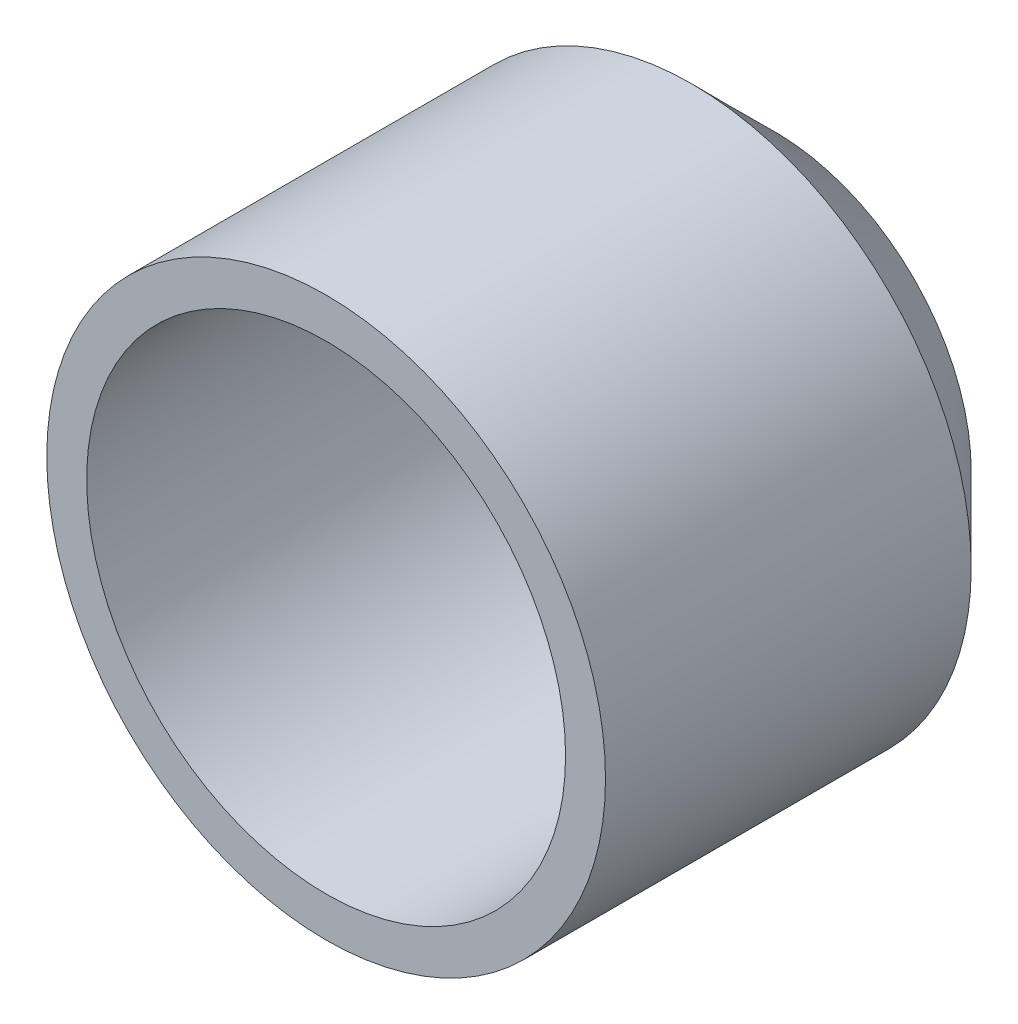
ISO-10303-21;
HEADER;
FILE_DESCRIPTION(('STEP AP214'),'2;1');
FILE_NAME('part.step','',(''),(''),'','','');
FILE_SCHEMA(('AUTOMOTIVE_DESIGN { 1 0 10303 214 1 1 1 1 }'));
ENDSEC;
DATA;
#1=APPLICATION_CONTEXT('core data for automotive mechanical design processes');
#2=APPLICATION_PROTOCOL_DEFINITION('international standard','automotive_design',2000,#1);
#3=PRODUCT_CONTEXT('',#1,'mechanical');
#4=PRODUCT('Part','Part','',(#3));
#5=PRODUCT_RELATED_PRODUCT_CATEGORY('part','',(#4));
#6=PRODUCT_DEFINITION_FORMATION('','',#4);
#7=PRODUCT_DEFINITION_CONTEXT('part definition',#1,'design');
#8=PRODUCT_DEFINITION('design','',#6,#7);
#9=PRODUCT_DEFINITION_SHAPE('','',#8);
#10=(LENGTH_UNIT() NAMED_UNIT(*) SI_UNIT(.MILLI.,.METRE.));
#11=(NAMED_UNIT(*) PLANE_ANGLE_UNIT() SI_UNIT($,.RADIAN.));
#12=(NAMED_UNIT(*) SI_UNIT($,.STERADIAN.) SOLID_ANGLE_UNIT());
#13=UNCERTAINTY_MEASURE_WITH_UNIT(LENGTH_MEASURE(1.E-05),#10,'distance_accuracy_value','');
#14=(GEOMETRIC_REPRESENTATION_CONTEXT(3) GLOBAL_UNCERTAINTY_ASSIGNED_CONTEXT((#13)) GLOBAL_UNIT_ASSIGNED_CONTEXT((#10,
#11,#12)) REPRESENTATION_CONTEXT('',''));
#15=CARTESIAN_POINT('',(0.,0.,0.));
#16=DIRECTION('',(0.,0.,1.));
#17=DIRECTION('',(1.,0.,0.));
#18=AXIS2_PLACEMENT_3D('',#15,#16,#17);
#19=CARTESIAN_POINT('',(0.,0.,0.));
#20=DIRECTION('',(0.,0.,1.));
#21=DIRECTION('',(1.,0.,0.));
#22=AXIS2_PLACEMENT_3D('',#19,#20,#21);
#23=PLANE('',#22);
#24=CARTESIAN_POINT('',(0.,0.,0.));
#25=DIRECTION('',(0.,0.,1.));
#26=DIRECTION('',(1.,0.,0.));
#27=AXIS2_PLACEMENT_3D('',#24,#25,#26);
#28=CIRCLE('',#27,19.6568542494924);
#29=CARTESIAN_POINT('',(19.6568542494924,0.,0.));
#30=VERTEX_POINT('',#29);
#31=EDGE_CURVE('E10',#30,#30,#28,.T.);
#32=ORIENTED_EDGE('',*,*,#31,.F.);
#33=EDGE_LOOP('',(#32));
#34=FACE_BOUND('',#33,.T.);
#35=ADVANCED_FACE('F33',(#34),#23,.F.);
#36=CARTESIAN_POINT('',(0.,0.,0.));
#37=DIRECTION('',(0.,0.,1.));
#38=DIRECTION('',(1.,0.,0.));
#39=AXIS2_PLACEMENT_3D('',#36,#37,#38);
#40=CONICAL_SURFACE('',#39,19.6568542494924,0.78539816339745);
#41=CARTESIAN_POINT('',(0.,0.,8.3431457505076));
#42=DIRECTION('',(0.,0.,1.));
#43=DIRECTION('',(1.,0.,0.));
#44=AXIS2_PLACEMENT_3D('',#41,#42,#43);
#45=CIRCLE('',#44,28.);
#46=CARTESIAN_POINT('',(28.,0.,8.3431457505076));
#47=VERTEX_POINT('',#46);
#48=EDGE_CURVE('E39',#47,#47,#45,.T.);
#49=ORIENTED_EDGE('',*,*,#48,.F.);
#50=EDGE_LOOP('',(#49));
#51=FACE_BOUND('',#50,.T.);
#52=ORIENTED_EDGE('',*,*,#31,.T.);
#53=EDGE_LOOP('',(#52));
#54=FACE_BOUND('',#53,.T.);
#55=ADVANCED_FACE('F81',(#51,#54),#40,.T.);
#56=CARTESIAN_POINT('',(0.,0.,4.));
#57=DIRECTION('',(0.,0.,1.));
#58=DIRECTION('',(1.,0.,0.));
#59=AXIS2_PLACEMENT_3D('',#56,#57,#58);
#60=CYLINDRICAL_SURFACE('',#59,28.);
#61=CARTESIAN_POINT('',(0.,0.,45.));
#62=DIRECTION('',(0.,0.,1.));
#63=DIRECTION('',(1.,0.,0.));
#64=AXIS2_PLACEMENT_3D('',#61,#62,#63);
#65=CIRCLE('',#64,28.);
#66=CARTESIAN_POINT('',(28.,0.,45.));
#67=VERTEX_POINT('',#66);
#68=EDGE_CURVE('E43',#67,#67,#65,.T.);
#69=ORIENTED_EDGE('',*,*,#68,.F.);
#70=EDGE_LOOP('',(#69));
#71=FACE_BOUND('',#70,.T.);
#72=ORIENTED_EDGE('',*,*,#48,.T.);
#73=EDGE_LOOP('',(#72));
#74=FACE_BOUND('',#73,.T.);
#75=ADVANCED_FACE('F76',(#71,#74),#60,.T.);
#76=CARTESIAN_POINT('',(0.,28.,45.));
#77=DIRECTION('',(0.,0.,-1.));
#78=DIRECTION('',(-1.,0.,0.));
#79=AXIS2_PLACEMENT_3D('',#76,#77,#78);
#80=PLANE('',#79);
#81=CARTESIAN_POINT('',(0.,0.,45.));
#82=DIRECTION('',(0.,0.,1.));
#83=DIRECTION('',(1.,0.,0.));
#84=AXIS2_PLACEMENT_3D('',#81,#82,#83);
#85=CIRCLE('',#84,24.);
#86=CARTESIAN_POINT('',(24.,0.,45.));
#87=VERTEX_POINT('',#86);
#88=EDGE_CURVE('E47',#87,#87,#85,.T.);
#89=ORIENTED_EDGE('',*,*,#88,.F.);
#90=EDGE_LOOP('',(#89));
#91=FACE_BOUND('',#90,.T.);
#92=ORIENTED_EDGE('',*,*,#68,.T.);
#93=EDGE_LOOP('',(#92));
#94=FACE_BOUND('',#93,.T.);
#95=ADVANCED_FACE('F70',(#91,#94),#80,.F.);
#96=CARTESIAN_POINT('',(0.,0.,4.));
#97=DIRECTION('',(0.,0.,1.));
#98=DIRECTION('',(1.,0.,0.));
#99=AXIS2_PLACEMENT_3D('',#96,#97,#98);
#100=CYLINDRICAL_SURFACE('',#99,24.);
#101=CARTESIAN_POINT('',(0.,0.,9.99999999999999));
#102=DIRECTION('',(0.,0.,1.));
#103=DIRECTION('',(1.,0.,0.));
#104=AXIS2_PLACEMENT_3D('',#101,#102,#103);
#105=CIRCLE('',#104,24.);
#106=CARTESIAN_POINT('',(24.,0.,9.99999999999999));
#107=VERTEX_POINT('',#106);
#108=EDGE_CURVE('E52',#107,#107,#105,.T.);
#109=ORIENTED_EDGE('',*,*,#108,.F.);
#110=EDGE_LOOP('',(#109));
#111=FACE_BOUND('',#110,.T.);
#112=ORIENTED_EDGE('',*,*,#88,.T.);
#113=EDGE_LOOP('',(#112));
#114=FACE_BOUND('',#113,.T.);
#115=ADVANCED_FACE('F64',(#111,#114),#100,.F.);
#116=CARTESIAN_POINT('',(0.,0.,9.99999999999999));
#117=DIRECTION('',(0.,0.,1.));
#118=DIRECTION('',(1.,0.,0.));
#119=AXIS2_PLACEMENT_3D('',#116,#117,#118);
#120=CONICAL_SURFACE('',#119,24.,0.785398163397449);
#121=CARTESIAN_POINT('',(0.,0.,4.));
#122=DIRECTION('',(0.,0.,1.));
#123=DIRECTION('',(1.,0.,0.));
#124=AXIS2_PLACEMENT_3D('',#121,#122,#123);
#125=CIRCLE('',#124,18.);
#126=CARTESIAN_POINT('',(18.,0.,4.));
#127=VERTEX_POINT('',#126);
#128=EDGE_CURVE('E55',#127,#127,#125,.T.);
#129=ORIENTED_EDGE('',*,*,#128,.F.);
#130=EDGE_LOOP('',(#129));
#131=FACE_BOUND('',#130,.T.);
#132=ORIENTED_EDGE('',*,*,#108,.T.);
#133=EDGE_LOOP('',(#132));
#134=FACE_BOUND('',#133,.T.);
#135=ADVANCED_FACE('F61',(#131,#134),#120,.F.);
#136=CARTESIAN_POINT('',(0.,18.,4.));
#137=DIRECTION('',(0.,0.,-1.));
#138=DIRECTION('',(-1.,0.,0.));
#139=AXIS2_PLACEMENT_3D('',#136,#137,#138);
#140=PLANE('',#139);
#141=ORIENTED_EDGE('',*,*,#128,.T.);
#142=EDGE_LOOP('',(#141));
#143=FACE_BOUND('',#142,.T.);
#144=ADVANCED_FACE('F59',(#143),#140,.F.);
#145=CLOSED_SHELL('',(#35,#55,#75,#95,#115,#135,#144));
#146=MANIFOLD_SOLID_BREP('B2',#145);
#147=ADVANCED_BREP_SHAPE_REPRESENTATION('',(#18,#146),#14);
#148=SHAPE_DEFINITION_REPRESENTATION(#9,#147);
ENDSEC;
END-ISO-10303-21;
